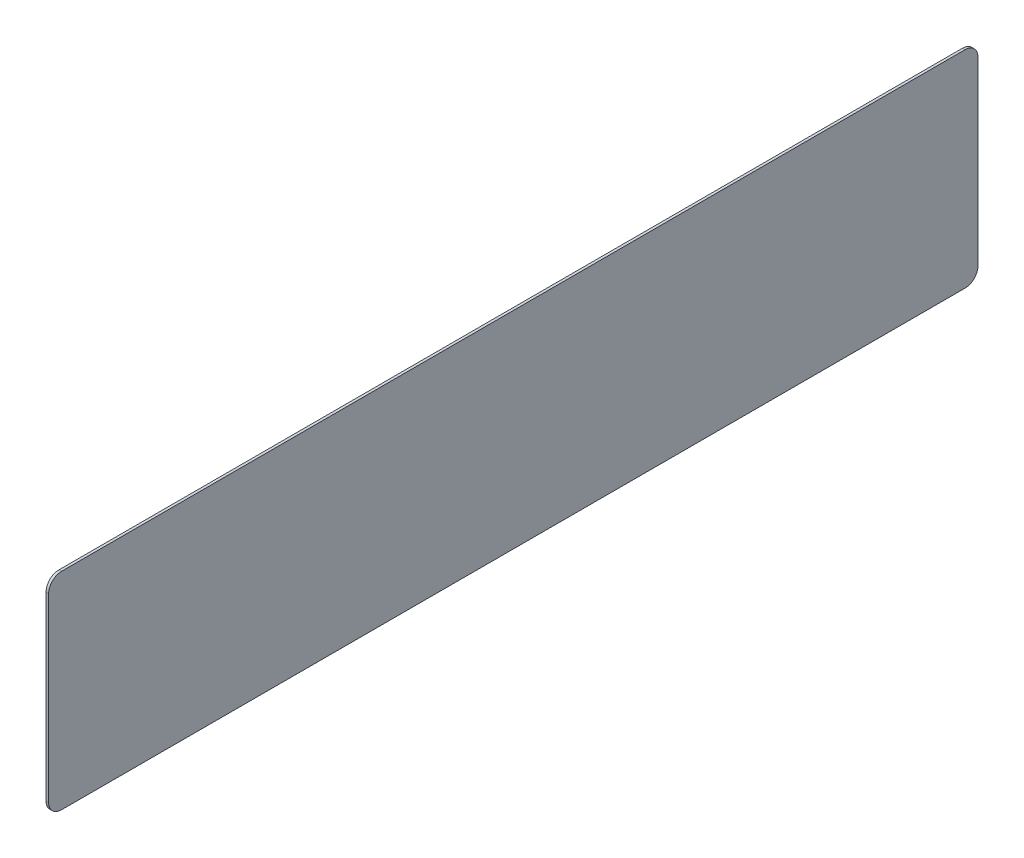
ISO-10303-21;
HEADER;
FILE_DESCRIPTION(('STEP AP214'),'2;1');
FILE_NAME('part.step','',(''),(''),'','','');
FILE_SCHEMA(('AUTOMOTIVE_DESIGN { 1 0 10303 214 1 1 1 1 }'));
ENDSEC;
DATA;
#1=APPLICATION_CONTEXT('core data for automotive mechanical design processes');
#2=APPLICATION_PROTOCOL_DEFINITION('international standard','automotive_design',2000,#1);
#3=PRODUCT_CONTEXT('',#1,'mechanical');
#4=PRODUCT('Part','Part','',(#3));
#5=PRODUCT_RELATED_PRODUCT_CATEGORY('part','',(#4));
#6=PRODUCT_DEFINITION_FORMATION('','',#4);
#7=PRODUCT_DEFINITION_CONTEXT('part definition',#1,'design');
#8=PRODUCT_DEFINITION('design','',#6,#7);
#9=PRODUCT_DEFINITION_SHAPE('','',#8);
#10=(LENGTH_UNIT() NAMED_UNIT(*) SI_UNIT(.MILLI.,.METRE.));
#11=(NAMED_UNIT(*) PLANE_ANGLE_UNIT() SI_UNIT($,.RADIAN.));
#12=(NAMED_UNIT(*) SI_UNIT($,.STERADIAN.) SOLID_ANGLE_UNIT());
#13=UNCERTAINTY_MEASURE_WITH_UNIT(LENGTH_MEASURE(1.E-05),#10,'distance_accuracy_value','');
#14=(GEOMETRIC_REPRESENTATION_CONTEXT(3) GLOBAL_UNCERTAINTY_ASSIGNED_CONTEXT((#13)) GLOBAL_UNIT_ASSIGNED_CONTEXT((#10,
#11,#12)) REPRESENTATION_CONTEXT('',''));
#15=CARTESIAN_POINT('',(0.,0.,0.));
#16=DIRECTION('',(0.,0.,1.));
#17=DIRECTION('',(1.,0.,0.));
#18=AXIS2_PLACEMENT_3D('',#15,#16,#17);
#19=CARTESIAN_POINT('',(0.5,-20.,-90.));
#20=DIRECTION('',(0.,0.,1.));
#21=DIRECTION('',(1.,0.,0.));
#22=AXIS2_PLACEMENT_3D('',#19,#20,#21);
#23=PLANE('',#22);
#24=DIRECTION('',(0.,1.,0.));
#25=VECTOR('',#24,1.);
#26=CARTESIAN_POINT('',(0.5,-20.,-90.));
#27=LINE('',#26,#25);
#28=CARTESIAN_POINT('',(0.5,-17.5,-90.));
#29=VERTEX_POINT('',#28);
#30=CARTESIAN_POINT('',(0.5,17.5,-90.));
#31=VERTEX_POINT('',#30);
#32=EDGE_CURVE('E116',#29,#31,#27,.T.);
#33=ORIENTED_EDGE('',*,*,#32,.F.);
#34=DIRECTION('',(-1.,0.,0.));
#35=VECTOR('',#34,1.);
#36=CARTESIAN_POINT('',(0.5,-17.5,-90.));
#37=LINE('',#36,#35);
#38=CARTESIAN_POINT('',(0.,-17.5,-90.));
#39=VERTEX_POINT('',#38);
#40=EDGE_CURVE('E101',#29,#39,#37,.T.);
#41=ORIENTED_EDGE('',*,*,#40,.T.);
#42=DIRECTION('',(0.,1.,0.));
#43=VECTOR('',#42,1.);
#44=CARTESIAN_POINT('',(0.,-20.,-90.));
#45=LINE('',#44,#43);
#46=CARTESIAN_POINT('',(0.,17.5,-90.));
#47=VERTEX_POINT('',#46);
#48=EDGE_CURVE('E113',#39,#47,#45,.T.);
#49=ORIENTED_EDGE('',*,*,#48,.T.);
#50=DIRECTION('',(-1.,0.,0.));
#51=VECTOR('',#50,1.);
#52=CARTESIAN_POINT('',(0.5,17.5,-90.));
#53=LINE('',#52,#51);
#54=EDGE_CURVE('E118',#47,#31,#53,.F.);
#55=ORIENTED_EDGE('',*,*,#54,.T.);
#56=EDGE_LOOP('',(#33,#41,#49,#55));
#57=FACE_BOUND('',#56,.T.);
#58=ADVANCED_FACE('F32',(#57),#23,.F.);
#59=CARTESIAN_POINT('',(0.5,20.,90.));
#60=DIRECTION('',(0.,-1.,0.));
#61=DIRECTION('',(0.,0.,-1.));
#62=AXIS2_PLACEMENT_3D('',#59,#60,#61);
#63=PLANE('',#62);
#64=DIRECTION('',(0.,0.,1.));
#65=VECTOR('',#64,1.);
#66=CARTESIAN_POINT('',(0.5,20.,90.));
#67=LINE('',#66,#65);
#68=CARTESIAN_POINT('',(0.5,20.,-87.4999999999999));
#69=VERTEX_POINT('',#68);
#70=CARTESIAN_POINT('',(0.5,20.,87.5));
#71=VERTEX_POINT('',#70);
#72=EDGE_CURVE('E167',#69,#71,#67,.T.);
#73=ORIENTED_EDGE('',*,*,#72,.F.);
#74=DIRECTION('',(-1.,0.,0.));
#75=VECTOR('',#74,1.);
#76=CARTESIAN_POINT('',(0.5,20.,-87.5));
#77=LINE('',#76,#75);
#78=CARTESIAN_POINT('',(0.,20.,-87.4999999999999));
#79=VERTEX_POINT('',#78);
#80=EDGE_CURVE('E151',#69,#79,#77,.T.);
#81=ORIENTED_EDGE('',*,*,#80,.T.);
#82=DIRECTION('',(0.,0.,1.));
#83=VECTOR('',#82,1.);
#84=CARTESIAN_POINT('',(0.,20.,90.));
#85=LINE('',#84,#83);
#86=CARTESIAN_POINT('',(0.,20.,87.5));
#87=VERTEX_POINT('',#86);
#88=EDGE_CURVE('E122',#79,#87,#85,.T.);
#89=ORIENTED_EDGE('',*,*,#88,.T.);
#90=DIRECTION('',(-1.,0.,0.));
#91=VECTOR('',#90,1.);
#92=CARTESIAN_POINT('',(0.5,20.,87.5));
#93=LINE('',#92,#91);
#94=EDGE_CURVE('E149',#87,#71,#93,.F.);
#95=ORIENTED_EDGE('',*,*,#94,.T.);
#96=EDGE_LOOP('',(#73,#81,#89,#95));
#97=FACE_BOUND('',#96,.T.);
#98=ADVANCED_FACE('F177',(#97),#63,.F.);
#99=CARTESIAN_POINT('',(0.5,-20.,90.));
#100=DIRECTION('',(0.,0.,-1.));
#101=DIRECTION('',(-1.,0.,0.));
#102=AXIS2_PLACEMENT_3D('',#99,#100,#101);
#103=PLANE('',#102);
#104=DIRECTION('',(0.,-1.,0.));
#105=VECTOR('',#104,1.);
#106=CARTESIAN_POINT('',(0.,-20.,90.));
#107=LINE('',#106,#105);
#108=CARTESIAN_POINT('',(0.,17.5,90.));
#109=VERTEX_POINT('',#108);
#110=CARTESIAN_POINT('',(0.,-17.5,90.));
#111=VERTEX_POINT('',#110);
#112=EDGE_CURVE('E125',#109,#111,#107,.T.);
#113=ORIENTED_EDGE('',*,*,#112,.T.);
#114=DIRECTION('',(-1.,0.,0.));
#115=VECTOR('',#114,1.);
#116=CARTESIAN_POINT('',(0.5,-17.5,90.));
#117=LINE('',#116,#115);
#118=CARTESIAN_POINT('',(0.5,-17.5,90.));
#119=VERTEX_POINT('',#118);
#120=EDGE_CURVE('E11',#111,#119,#117,.F.);
#121=ORIENTED_EDGE('',*,*,#120,.T.);
#122=DIRECTION('',(0.,-1.,0.));
#123=VECTOR('',#122,1.);
#124=CARTESIAN_POINT('',(0.5,-20.,90.));
#125=LINE('',#124,#123);
#126=CARTESIAN_POINT('',(0.5,17.5,90.));
#127=VERTEX_POINT('',#126);
#128=EDGE_CURVE('E157',#127,#119,#125,.T.);
#129=ORIENTED_EDGE('',*,*,#128,.F.);
#130=DIRECTION('',(-1.,0.,0.));
#131=VECTOR('',#130,1.);
#132=CARTESIAN_POINT('',(0.5,17.5,90.));
#133=LINE('',#132,#131);
#134=EDGE_CURVE('E40',#127,#109,#133,.T.);
#135=ORIENTED_EDGE('',*,*,#134,.T.);
#136=EDGE_LOOP('',(#113,#121,#129,#135));
#137=FACE_BOUND('',#136,.T.);
#138=ADVANCED_FACE('F156',(#137),#103,.F.);
#139=CARTESIAN_POINT('',(0.5,-20.,90.));
#140=DIRECTION('',(0.,1.,0.));
#141=DIRECTION('',(0.,0.,1.));
#142=AXIS2_PLACEMENT_3D('',#139,#140,#141);
#143=PLANE('',#142);
#144=DIRECTION('',(0.,0.,-1.));
#145=VECTOR('',#144,1.);
#146=CARTESIAN_POINT('',(0.,-20.,90.));
#147=LINE('',#146,#145);
#148=CARTESIAN_POINT('',(0.,-20.,87.5));
#149=VERTEX_POINT('',#148);
#150=CARTESIAN_POINT('',(0.,-20.,-87.4999999999999));
#151=VERTEX_POINT('',#150);
#152=EDGE_CURVE('E132',#149,#151,#147,.T.);
#153=ORIENTED_EDGE('',*,*,#152,.T.);
#154=DIRECTION('',(-1.,0.,0.));
#155=VECTOR('',#154,1.);
#156=CARTESIAN_POINT('',(0.5,-20.,-87.5));
#157=LINE('',#156,#155);
#158=CARTESIAN_POINT('',(0.5,-20.,-87.4999999999999));
#159=VERTEX_POINT('',#158);
#160=EDGE_CURVE('E102',#151,#159,#157,.F.);
#161=ORIENTED_EDGE('',*,*,#160,.T.);
#162=DIRECTION('',(0.,0.,-1.));
#163=VECTOR('',#162,1.);
#164=CARTESIAN_POINT('',(0.5,-20.,90.));
#165=LINE('',#164,#163);
#166=CARTESIAN_POINT('',(0.5,-20.,87.5));
#167=VERTEX_POINT('',#166);
#168=EDGE_CURVE('E128',#167,#159,#165,.T.);
#169=ORIENTED_EDGE('',*,*,#168,.F.);
#170=DIRECTION('',(-1.,0.,0.));
#171=VECTOR('',#170,1.);
#172=CARTESIAN_POINT('',(0.5,-20.,87.5));
#173=LINE('',#172,#171);
#174=EDGE_CURVE('E107',#167,#149,#173,.T.);
#175=ORIENTED_EDGE('',*,*,#174,.T.);
#176=EDGE_LOOP('',(#153,#161,#169,#175));
#177=FACE_BOUND('',#176,.T.);
#178=ADVANCED_FACE('F165',(#177),#143,.F.);
#179=CARTESIAN_POINT('',(0.5,0.,0.));
#180=DIRECTION('',(-1.,0.,0.));
#181=DIRECTION('',(0.,0.,1.));
#182=AXIS2_PLACEMENT_3D('',#179,#180,#181);
#183=PLANE('',#182);
#184=ORIENTED_EDGE('',*,*,#168,.T.);
#185=CARTESIAN_POINT('',(0.5,-17.5,-87.5));
#186=DIRECTION('',(-1.,0.,0.));
#187=DIRECTION('',(0.,0.,1.));
#188=AXIS2_PLACEMENT_3D('',#185,#186,#187);
#189=CIRCLE('',#188,2.5);
#190=EDGE_CURVE('E147',#159,#29,#189,.F.);
#191=ORIENTED_EDGE('',*,*,#190,.T.);
#192=ORIENTED_EDGE('',*,*,#32,.T.);
#193=CARTESIAN_POINT('',(0.5,17.5,-87.5));
#194=DIRECTION('',(-1.,0.,0.));
#195=DIRECTION('',(0.,0.,1.));
#196=AXIS2_PLACEMENT_3D('',#193,#194,#195);
#197=CIRCLE('',#196,2.5);
#198=EDGE_CURVE('E145',#31,#69,#197,.F.);
#199=ORIENTED_EDGE('',*,*,#198,.T.);
#200=ORIENTED_EDGE('',*,*,#72,.T.);
#201=CARTESIAN_POINT('',(0.5,17.5,87.5));
#202=DIRECTION('',(-1.,0.,0.));
#203=DIRECTION('',(0.,0.,1.));
#204=AXIS2_PLACEMENT_3D('',#201,#202,#203);
#205=CIRCLE('',#204,2.5);
#206=EDGE_CURVE('E52',#71,#127,#205,.F.);
#207=ORIENTED_EDGE('',*,*,#206,.T.);
#208=ORIENTED_EDGE('',*,*,#128,.T.);
#209=CARTESIAN_POINT('',(0.5,-17.5,87.5));
#210=DIRECTION('',(-1.,0.,0.));
#211=DIRECTION('',(0.,0.,1.));
#212=AXIS2_PLACEMENT_3D('',#209,#210,#211);
#213=CIRCLE('',#212,2.5);
#214=EDGE_CURVE('E143',#119,#167,#213,.F.);
#215=ORIENTED_EDGE('',*,*,#214,.T.);
#216=EDGE_LOOP('',(#184,#191,#192,#199,#200,#207,#208,#215));
#217=FACE_BOUND('',#216,.T.);
#218=ADVANCED_FACE('F171',(#217),#183,.F.);
#219=CARTESIAN_POINT('',(0.,0.,0.));
#220=DIRECTION('',(-1.,0.,0.));
#221=DIRECTION('',(0.,0.,1.));
#222=AXIS2_PLACEMENT_3D('',#219,#220,#221);
#223=PLANE('',#222);
#224=ORIENTED_EDGE('',*,*,#48,.F.);
#225=CARTESIAN_POINT('',(0.,-17.5,-87.5));
#226=DIRECTION('',(-1.,0.,0.));
#227=DIRECTION('',(0.,0.,1.));
#228=AXIS2_PLACEMENT_3D('',#225,#226,#227);
#229=CIRCLE('',#228,2.5);
#230=EDGE_CURVE('E97',#39,#151,#229,.T.);
#231=ORIENTED_EDGE('',*,*,#230,.T.);
#232=ORIENTED_EDGE('',*,*,#152,.F.);
#233=CARTESIAN_POINT('',(0.,-17.5,87.5));
#234=DIRECTION('',(-1.,0.,0.));
#235=DIRECTION('',(0.,0.,1.));
#236=AXIS2_PLACEMENT_3D('',#233,#234,#235);
#237=CIRCLE('',#236,2.5);
#238=EDGE_CURVE('E136',#149,#111,#237,.T.);
#239=ORIENTED_EDGE('',*,*,#238,.T.);
#240=ORIENTED_EDGE('',*,*,#112,.F.);
#241=CARTESIAN_POINT('',(0.,17.5,87.5));
#242=DIRECTION('',(-1.,0.,0.));
#243=DIRECTION('',(0.,0.,1.));
#244=AXIS2_PLACEMENT_3D('',#241,#242,#243);
#245=CIRCLE('',#244,2.5);
#246=EDGE_CURVE('E117',#109,#87,#245,.T.);
#247=ORIENTED_EDGE('',*,*,#246,.T.);
#248=ORIENTED_EDGE('',*,*,#88,.F.);
#249=CARTESIAN_POINT('',(0.,17.5,-87.5));
#250=DIRECTION('',(-1.,0.,0.));
#251=DIRECTION('',(0.,0.,1.));
#252=AXIS2_PLACEMENT_3D('',#249,#250,#251);
#253=CIRCLE('',#252,2.5);
#254=EDGE_CURVE('E108',#79,#47,#253,.T.);
#255=ORIENTED_EDGE('',*,*,#254,.T.);
#256=EDGE_LOOP('',(#224,#231,#232,#239,#240,#247,#248,#255));
#257=FACE_BOUND('',#256,.T.);
#258=ADVANCED_FACE('F120',(#257),#223,.T.);
#259=CARTESIAN_POINT('',(0.5,-17.5,-87.5));
#260=DIRECTION('',(-1.,0.,0.));
#261=DIRECTION('',(0.,0.,1.));
#262=AXIS2_PLACEMENT_3D('',#259,#260,#261);
#263=CYLINDRICAL_SURFACE('',#262,2.5);
#264=ORIENTED_EDGE('',*,*,#190,.F.);
#265=ORIENTED_EDGE('',*,*,#160,.F.);
#266=ORIENTED_EDGE('',*,*,#230,.F.);
#267=ORIENTED_EDGE('',*,*,#40,.F.);
#268=EDGE_LOOP('',(#264,#265,#266,#267));
#269=FACE_BOUND('',#268,.T.);
#270=ADVANCED_FACE('F100',(#269),#263,.T.);
#271=CARTESIAN_POINT('',(0.5,17.5,-87.5));
#272=DIRECTION('',(-1.,0.,0.));
#273=DIRECTION('',(0.,0.,1.));
#274=AXIS2_PLACEMENT_3D('',#271,#272,#273);
#275=CYLINDRICAL_SURFACE('',#274,2.5);
#276=ORIENTED_EDGE('',*,*,#198,.F.);
#277=ORIENTED_EDGE('',*,*,#54,.F.);
#278=ORIENTED_EDGE('',*,*,#254,.F.);
#279=ORIENTED_EDGE('',*,*,#80,.F.);
#280=EDGE_LOOP('',(#276,#277,#278,#279));
#281=FACE_BOUND('',#280,.T.);
#282=ADVANCED_FACE('F175',(#281),#275,.T.);
#283=CARTESIAN_POINT('',(0.5,-17.5,87.5));
#284=DIRECTION('',(-1.,0.,0.));
#285=DIRECTION('',(0.,0.,1.));
#286=AXIS2_PLACEMENT_3D('',#283,#284,#285);
#287=CYLINDRICAL_SURFACE('',#286,2.5);
#288=ORIENTED_EDGE('',*,*,#214,.F.);
#289=ORIENTED_EDGE('',*,*,#120,.F.);
#290=ORIENTED_EDGE('',*,*,#238,.F.);
#291=ORIENTED_EDGE('',*,*,#174,.F.);
#292=EDGE_LOOP('',(#288,#289,#290,#291));
#293=FACE_BOUND('',#292,.T.);
#294=ADVANCED_FACE('F162',(#293),#287,.T.);
#295=CARTESIAN_POINT('',(0.5,17.5,87.5));
#296=DIRECTION('',(-1.,0.,0.));
#297=DIRECTION('',(0.,0.,1.));
#298=AXIS2_PLACEMENT_3D('',#295,#296,#297);
#299=CYLINDRICAL_SURFACE('',#298,2.5);
#300=ORIENTED_EDGE('',*,*,#206,.F.);
#301=ORIENTED_EDGE('',*,*,#94,.F.);
#302=ORIENTED_EDGE('',*,*,#246,.F.);
#303=ORIENTED_EDGE('',*,*,#134,.F.);
#304=EDGE_LOOP('',(#300,#301,#302,#303));
#305=FACE_BOUND('',#304,.T.);
#306=ADVANCED_FACE('F34',(#305),#299,.T.);
#307=CLOSED_SHELL('',(#58,#98,#138,#178,#218,#258,#270,#282,#294,#306));
#308=MANIFOLD_SOLID_BREP('B2',#307);
#309=ADVANCED_BREP_SHAPE_REPRESENTATION('',(#18,#308),#14);
#310=SHAPE_DEFINITION_REPRESENTATION(#9,#309);
ENDSEC;
END-ISO-10303-21;
